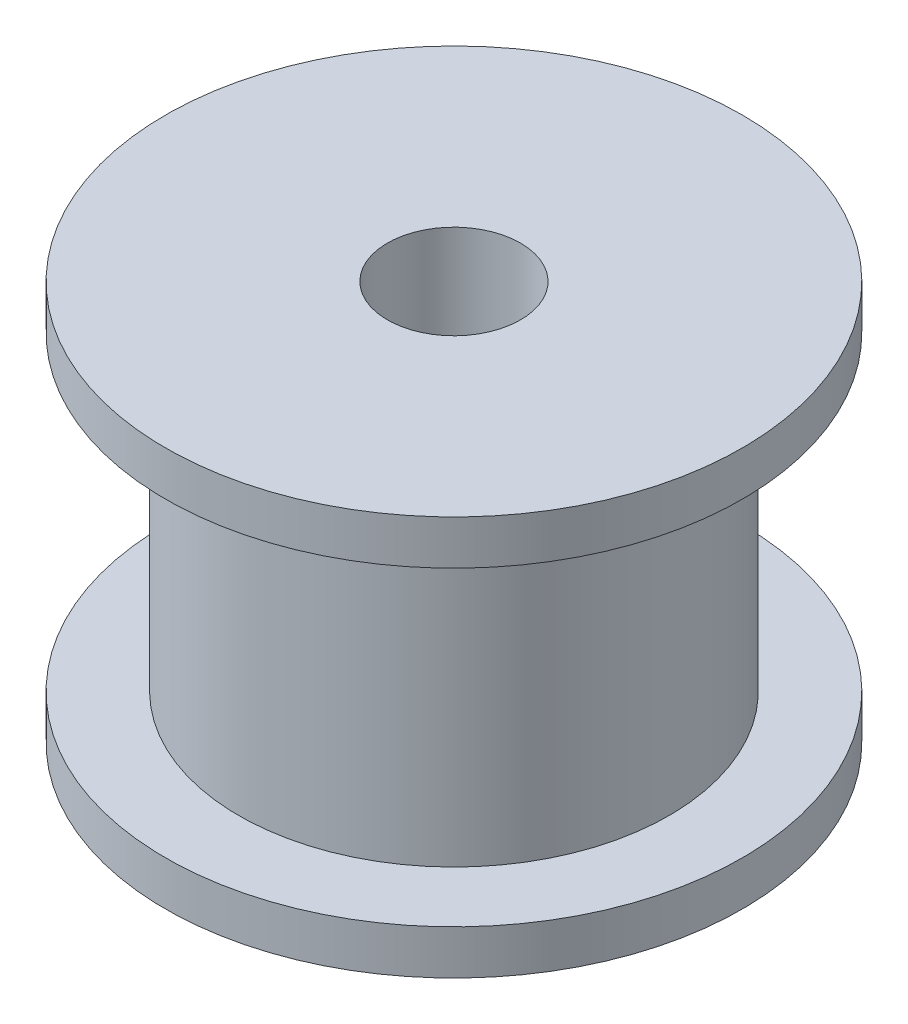
ISO-10303-21;
HEADER;
FILE_DESCRIPTION(('STEP AP214'),'2;1');
FILE_NAME('part.step','',(''),(''),'','','');
FILE_SCHEMA(('AUTOMOTIVE_DESIGN { 1 0 10303 214 1 1 1 1 }'));
ENDSEC;
DATA;
#1=APPLICATION_CONTEXT('core data for automotive mechanical design processes');
#2=APPLICATION_PROTOCOL_DEFINITION('international standard','automotive_design',2000,#1);
#3=PRODUCT_CONTEXT('',#1,'mechanical');
#4=PRODUCT('Part','Part','',(#3));
#5=PRODUCT_RELATED_PRODUCT_CATEGORY('part','',(#4));
#6=PRODUCT_DEFINITION_FORMATION('','',#4);
#7=PRODUCT_DEFINITION_CONTEXT('part definition',#1,'design');
#8=PRODUCT_DEFINITION('design','',#6,#7);
#9=PRODUCT_DEFINITION_SHAPE('','',#8);
#10=(LENGTH_UNIT() NAMED_UNIT(*) SI_UNIT(.MILLI.,.METRE.));
#11=(NAMED_UNIT(*) PLANE_ANGLE_UNIT() SI_UNIT($,.RADIAN.));
#12=(NAMED_UNIT(*) SI_UNIT($,.STERADIAN.) SOLID_ANGLE_UNIT());
#13=UNCERTAINTY_MEASURE_WITH_UNIT(LENGTH_MEASURE(1.E-05),#10,'distance_accuracy_value','');
#14=(GEOMETRIC_REPRESENTATION_CONTEXT(3) GLOBAL_UNCERTAINTY_ASSIGNED_CONTEXT((#13)) GLOBAL_UNIT_ASSIGNED_CONTEXT((#10,
#11,#12)) REPRESENTATION_CONTEXT('',''));
#15=CARTESIAN_POINT('',(0.,0.,0.));
#16=DIRECTION('',(0.,0.,1.));
#17=DIRECTION('',(1.,0.,0.));
#18=AXIS2_PLACEMENT_3D('',#15,#16,#17);
#19=CARTESIAN_POINT('',(0.,3.98382031084887,-6.5));
#20=DIRECTION('',(0.,-1.,0.));
#21=DIRECTION('',(0.,0.,-1.));
#22=AXIS2_PLACEMENT_3D('',#19,#20,#21);
#23=PLANE('',#22);
#24=CARTESIAN_POINT('',(0.,3.98382031084887,0.));
#25=DIRECTION('',(0.,-1.,0.));
#26=DIRECTION('',(0.,0.,-1.));
#27=AXIS2_PLACEMENT_3D('',#24,#25,#26);
#28=CIRCLE('',#27,6.5);
#29=CARTESIAN_POINT('',(0.,3.98382031084887,-6.5));
#30=VERTEX_POINT('',#29);
#31=EDGE_CURVE('E10',#30,#30,#28,.T.);
#32=ORIENTED_EDGE('',*,*,#31,.T.);
#33=EDGE_LOOP('',(#32));
#34=FACE_BOUND('',#33,.T.);
#35=CARTESIAN_POINT('',(0.,3.98382031084887,0.));
#36=DIRECTION('',(0.,-1.,0.));
#37=DIRECTION('',(0.,0.,-1.));
#38=AXIS2_PLACEMENT_3D('',#35,#36,#37);
#39=CIRCLE('',#38,4.85);
#40=CARTESIAN_POINT('',(0.,3.98382031084887,-4.85));
#41=VERTEX_POINT('',#40);
#42=EDGE_CURVE('E62',#41,#41,#39,.T.);
#43=ORIENTED_EDGE('',*,*,#42,.F.);
#44=EDGE_LOOP('',(#43));
#45=FACE_BOUND('',#44,.T.);
#46=ADVANCED_FACE('F34',(#34,#45),#23,.T.);
#47=CARTESIAN_POINT('',(0.,0.,0.));
#48=DIRECTION('',(0.,-1.,0.));
#49=DIRECTION('',(0.,0.,-1.));
#50=AXIS2_PLACEMENT_3D('',#47,#48,#49);
#51=CYLINDRICAL_SURFACE('',#50,6.5);
#52=CARTESIAN_POINT('',(0.,4.98382031084887,0.));
#53=DIRECTION('',(0.,-1.,0.));
#54=DIRECTION('',(0.,0.,-1.));
#55=AXIS2_PLACEMENT_3D('',#52,#53,#54);
#56=CIRCLE('',#55,6.5);
#57=CARTESIAN_POINT('',(0.,4.98382031084887,-6.5));
#58=VERTEX_POINT('',#57);
#59=EDGE_CURVE('E40',#58,#58,#56,.T.);
#60=ORIENTED_EDGE('',*,*,#59,.T.);
#61=EDGE_LOOP('',(#60));
#62=FACE_BOUND('',#61,.T.);
#63=ORIENTED_EDGE('',*,*,#31,.F.);
#64=EDGE_LOOP('',(#63));
#65=FACE_BOUND('',#64,.T.);
#66=ADVANCED_FACE('F70',(#62,#65),#51,.T.);
#67=CARTESIAN_POINT('',(0.,4.98382031084887,-1.5));
#68=DIRECTION('',(0.,1.,0.));
#69=DIRECTION('',(0.,0.,1.));
#70=AXIS2_PLACEMENT_3D('',#67,#68,#69);
#71=PLANE('',#70);
#72=CARTESIAN_POINT('',(0.,4.98382031084887,0.));
#73=DIRECTION('',(0.,-1.,0.));
#74=DIRECTION('',(0.,0.,-1.));
#75=AXIS2_PLACEMENT_3D('',#72,#73,#74);
#76=CIRCLE('',#75,1.5);
#77=CARTESIAN_POINT('',(0.,4.98382031084887,-1.5));
#78=VERTEX_POINT('',#77);
#79=EDGE_CURVE('E44',#78,#78,#76,.T.);
#80=ORIENTED_EDGE('',*,*,#79,.T.);
#81=EDGE_LOOP('',(#80));
#82=FACE_BOUND('',#81,.T.);
#83=ORIENTED_EDGE('',*,*,#59,.F.);
#84=EDGE_LOOP('',(#83));
#85=FACE_BOUND('',#84,.T.);
#86=ADVANCED_FACE('F74',(#82,#85),#71,.T.);
#87=CARTESIAN_POINT('',(0.,0.,0.));
#88=DIRECTION('',(0.,-1.,0.));
#89=DIRECTION('',(0.,0.,-1.));
#90=AXIS2_PLACEMENT_3D('',#87,#88,#89);
#91=CYLINDRICAL_SURFACE('',#90,1.5);
#92=CARTESIAN_POINT('',(0.,-4.01617968915113,0.));
#93=DIRECTION('',(0.,-1.,0.));
#94=DIRECTION('',(0.,0.,-1.));
#95=AXIS2_PLACEMENT_3D('',#92,#93,#94);
#96=CIRCLE('',#95,1.5);
#97=CARTESIAN_POINT('',(0.,-4.01617968915113,-1.5));
#98=VERTEX_POINT('',#97);
#99=EDGE_CURVE('E48',#98,#98,#96,.T.);
#100=ORIENTED_EDGE('',*,*,#99,.T.);
#101=EDGE_LOOP('',(#100));
#102=FACE_BOUND('',#101,.T.);
#103=ORIENTED_EDGE('',*,*,#79,.F.);
#104=EDGE_LOOP('',(#103));
#105=FACE_BOUND('',#104,.T.);
#106=ADVANCED_FACE('F78',(#102,#105),#91,.F.);
#107=CARTESIAN_POINT('',(0.,-4.01617968915113,-6.5));
#108=DIRECTION('',(0.,-1.,0.));
#109=DIRECTION('',(0.,0.,-1.));
#110=AXIS2_PLACEMENT_3D('',#107,#108,#109);
#111=PLANE('',#110);
#112=CARTESIAN_POINT('',(0.,-4.01617968915113,0.));
#113=DIRECTION('',(0.,-1.,0.));
#114=DIRECTION('',(0.,0.,-1.));
#115=AXIS2_PLACEMENT_3D('',#112,#113,#114);
#116=CIRCLE('',#115,6.5);
#117=CARTESIAN_POINT('',(0.,-4.01617968915113,-6.5));
#118=VERTEX_POINT('',#117);
#119=EDGE_CURVE('E53',#118,#118,#116,.T.);
#120=ORIENTED_EDGE('',*,*,#119,.T.);
#121=EDGE_LOOP('',(#120));
#122=FACE_BOUND('',#121,.T.);
#123=ORIENTED_EDGE('',*,*,#99,.F.);
#124=EDGE_LOOP('',(#123));
#125=FACE_BOUND('',#124,.T.);
#126=ADVANCED_FACE('F85',(#122,#125),#111,.T.);
#127=CARTESIAN_POINT('',(0.,0.,0.));
#128=DIRECTION('',(0.,-1.,0.));
#129=DIRECTION('',(0.,0.,-1.));
#130=AXIS2_PLACEMENT_3D('',#127,#128,#129);
#131=CYLINDRICAL_SURFACE('',#130,6.5);
#132=CARTESIAN_POINT('',(0.,-3.01617968915113,0.));
#133=DIRECTION('',(0.,-1.,0.));
#134=DIRECTION('',(0.,0.,-1.));
#135=AXIS2_PLACEMENT_3D('',#132,#133,#134);
#136=CIRCLE('',#135,6.5);
#137=CARTESIAN_POINT('',(0.,-3.01617968915113,-6.5));
#138=VERTEX_POINT('',#137);
#139=EDGE_CURVE('E56',#138,#138,#136,.T.);
#140=ORIENTED_EDGE('',*,*,#139,.T.);
#141=EDGE_LOOP('',(#140));
#142=FACE_BOUND('',#141,.T.);
#143=ORIENTED_EDGE('',*,*,#119,.F.);
#144=EDGE_LOOP('',(#143));
#145=FACE_BOUND('',#144,.T.);
#146=ADVANCED_FACE('F89',(#142,#145),#131,.T.);
#147=CARTESIAN_POINT('',(0.,-3.01617968915113,-4.85));
#148=DIRECTION('',(0.,1.,0.));
#149=DIRECTION('',(0.,0.,1.));
#150=AXIS2_PLACEMENT_3D('',#147,#148,#149);
#151=PLANE('',#150);
#152=CARTESIAN_POINT('',(0.,-3.01617968915113,0.));
#153=DIRECTION('',(0.,-1.,0.));
#154=DIRECTION('',(0.,0.,-1.));
#155=AXIS2_PLACEMENT_3D('',#152,#153,#154);
#156=CIRCLE('',#155,4.85);
#157=CARTESIAN_POINT('',(0.,-3.01617968915113,-4.85));
#158=VERTEX_POINT('',#157);
#159=EDGE_CURVE('E59',#158,#158,#156,.T.);
#160=ORIENTED_EDGE('',*,*,#159,.T.);
#161=EDGE_LOOP('',(#160));
#162=FACE_BOUND('',#161,.T.);
#163=ORIENTED_EDGE('',*,*,#139,.F.);
#164=EDGE_LOOP('',(#163));
#165=FACE_BOUND('',#164,.T.);
#166=ADVANCED_FACE('F93',(#162,#165),#151,.T.);
#167=CARTESIAN_POINT('',(0.,0.,0.));
#168=DIRECTION('',(0.,-1.,0.));
#169=DIRECTION('',(0.,0.,-1.));
#170=AXIS2_PLACEMENT_3D('',#167,#168,#169);
#171=CYLINDRICAL_SURFACE('',#170,4.85);
#172=ORIENTED_EDGE('',*,*,#42,.T.);
#173=EDGE_LOOP('',(#172));
#174=FACE_BOUND('',#173,.T.);
#175=ORIENTED_EDGE('',*,*,#159,.F.);
#176=EDGE_LOOP('',(#175));
#177=FACE_BOUND('',#176,.T.);
#178=ADVANCED_FACE('F66',(#174,#177),#171,.T.);
#179=CLOSED_SHELL('',(#46,#66,#86,#106,#126,#146,#166,#178));
#180=MANIFOLD_SOLID_BREP('B2',#179);
#181=ADVANCED_BREP_SHAPE_REPRESENTATION('',(#18,#180),#14);
#182=SHAPE_DEFINITION_REPRESENTATION(#9,#181);
ENDSEC;
END-ISO-10303-21;
